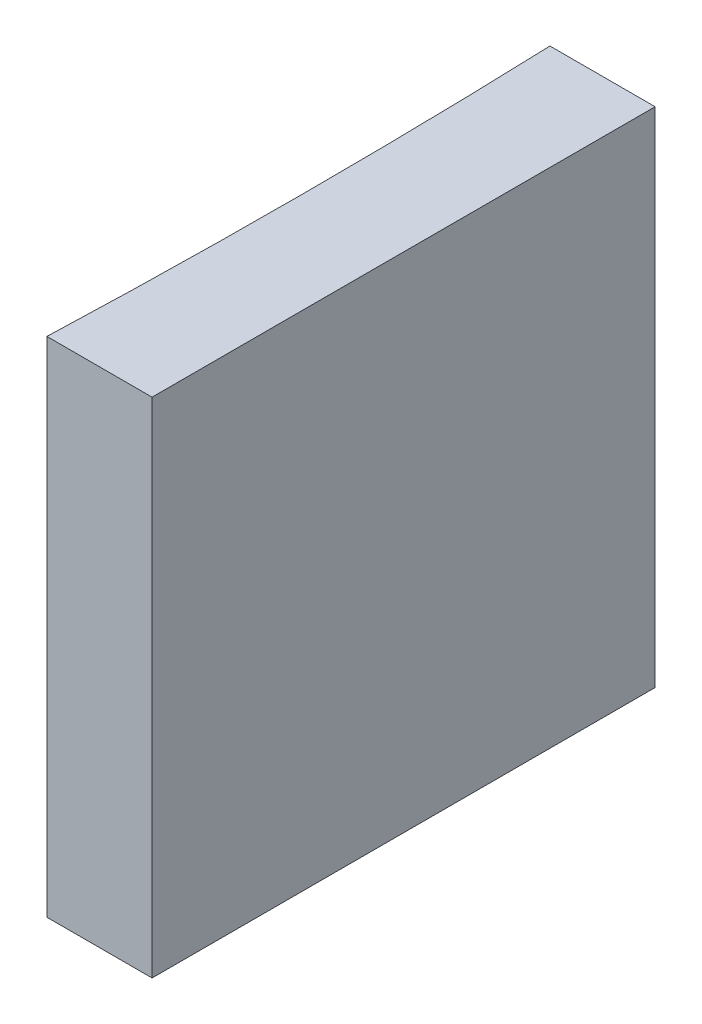
ISO-10303-21;
HEADER;
FILE_DESCRIPTION(('STEP AP214'),'2;1');
FILE_NAME('part.step','',(''),(''),'','','');
FILE_SCHEMA(('AUTOMOTIVE_DESIGN { 1 0 10303 214 1 1 1 1 }'));
ENDSEC;
DATA;
#1=APPLICATION_CONTEXT('core data for automotive mechanical design processes');
#2=APPLICATION_PROTOCOL_DEFINITION('international standard','automotive_design',2000,#1);
#3=PRODUCT_CONTEXT('',#1,'mechanical');
#4=PRODUCT('Part','Part','',(#3));
#5=PRODUCT_RELATED_PRODUCT_CATEGORY('part','',(#4));
#6=PRODUCT_DEFINITION_FORMATION('','',#4);
#7=PRODUCT_DEFINITION_CONTEXT('part definition',#1,'design');
#8=PRODUCT_DEFINITION('design','',#6,#7);
#9=PRODUCT_DEFINITION_SHAPE('','',#8);
#10=(LENGTH_UNIT() NAMED_UNIT(*) SI_UNIT(.MILLI.,.METRE.));
#11=(NAMED_UNIT(*) PLANE_ANGLE_UNIT() SI_UNIT($,.RADIAN.));
#12=(NAMED_UNIT(*) SI_UNIT($,.STERADIAN.) SOLID_ANGLE_UNIT());
#13=UNCERTAINTY_MEASURE_WITH_UNIT(LENGTH_MEASURE(1.E-05),#10,'distance_accuracy_value','');
#14=(GEOMETRIC_REPRESENTATION_CONTEXT(3) GLOBAL_UNCERTAINTY_ASSIGNED_CONTEXT((#13)) GLOBAL_UNIT_ASSIGNED_CONTEXT((#10,
#11,#12)) REPRESENTATION_CONTEXT('',''));
#15=CARTESIAN_POINT('',(0.,0.,0.));
#16=DIRECTION('',(0.,0.,1.));
#17=DIRECTION('',(1.,0.,0.));
#18=AXIS2_PLACEMENT_3D('',#15,#16,#17);
#19=CARTESIAN_POINT('',(0.,10.,0.));
#20=DIRECTION('',(0.,0.,1.));
#21=DIRECTION('',(1.,0.,0.));
#22=AXIS2_PLACEMENT_3D('',#19,#20,#21);
#23=PLANE('',#22);
#24=DIRECTION('',(-1.,0.,0.));
#25=VECTOR('',#24,1.);
#26=CARTESIAN_POINT('',(0.,0.,0.));
#27=LINE('',#26,#25);
#28=CARTESIAN_POINT('',(0.,0.,0.));
#29=VERTEX_POINT('',#28);
#30=CARTESIAN_POINT('',(-2.09090608475551,0.,0.));
#31=VERTEX_POINT('',#30);
#32=EDGE_CURVE('E98',#29,#31,#27,.T.);
#33=ORIENTED_EDGE('',*,*,#32,.T.);
#34=DIRECTION('',(0.,-1.,0.));
#35=VECTOR('',#34,1.);
#36=CARTESIAN_POINT('',(-2.09090608475551,10.,0.));
#37=LINE('',#36,#35);
#38=CARTESIAN_POINT('',(-2.09090608475551,10.,0.));
#39=VERTEX_POINT('',#38);
#40=EDGE_CURVE('E11',#39,#31,#37,.T.);
#41=ORIENTED_EDGE('',*,*,#40,.F.);
#42=DIRECTION('',(-1.,0.,0.));
#43=VECTOR('',#42,1.);
#44=CARTESIAN_POINT('',(0.,10.,0.));
#45=LINE('',#44,#43);
#46=CARTESIAN_POINT('',(0.,10.,0.));
#47=VERTEX_POINT('',#46);
#48=EDGE_CURVE('E86',#47,#39,#45,.T.);
#49=ORIENTED_EDGE('',*,*,#48,.F.);
#50=DIRECTION('',(0.,-1.,0.));
#51=VECTOR('',#50,1.);
#52=CARTESIAN_POINT('',(0.,10.,0.));
#53=LINE('',#52,#51);
#54=EDGE_CURVE('E94',#47,#29,#53,.T.);
#55=ORIENTED_EDGE('',*,*,#54,.T.);
#56=EDGE_LOOP('',(#33,#41,#49,#55));
#57=FACE_BOUND('',#56,.T.);
#58=ADVANCED_FACE('F35',(#57),#23,.F.);
#59=CARTESIAN_POINT('',(-139.55,10.,5.00000000000002));
#60=DIRECTION('',(0.,-1.,0.));
#61=DIRECTION('',(0.,0.,-1.));
#62=AXIS2_PLACEMENT_3D('',#59,#60,#61);
#63=CYLINDRICAL_SURFACE('',#62,137.55);
#64=CARTESIAN_POINT('',(-139.55,0.,5.00000000000002));
#65=DIRECTION('',(0.,-1.,0.));
#66=DIRECTION('',(0.,0.,1.));
#67=AXIS2_PLACEMENT_3D('',#64,#65,#66);
#68=CIRCLE('',#67,137.55);
#69=CARTESIAN_POINT('',(-2.09090608475554,0.,10.));
#70=VERTEX_POINT('',#69);
#71=EDGE_CURVE('E90',#31,#70,#68,.T.);
#72=ORIENTED_EDGE('',*,*,#71,.T.);
#73=DIRECTION('',(0.,-1.,0.));
#74=VECTOR('',#73,1.);
#75=CARTESIAN_POINT('',(-2.09090608475554,10.,10.));
#76=LINE('',#75,#74);
#77=CARTESIAN_POINT('',(-2.09090608475554,10.,10.));
#78=VERTEX_POINT('',#77);
#79=EDGE_CURVE('E43',#78,#70,#76,.T.);
#80=ORIENTED_EDGE('',*,*,#79,.F.);
#81=CARTESIAN_POINT('',(-139.55,10.,5.00000000000002));
#82=DIRECTION('',(0.,-1.,0.));
#83=DIRECTION('',(0.,0.,1.));
#84=AXIS2_PLACEMENT_3D('',#81,#82,#83);
#85=CIRCLE('',#84,137.55);
#86=EDGE_CURVE('E81',#39,#78,#85,.T.);
#87=ORIENTED_EDGE('',*,*,#86,.F.);
#88=ORIENTED_EDGE('',*,*,#40,.T.);
#89=EDGE_LOOP('',(#72,#80,#87,#88));
#90=FACE_BOUND('',#89,.T.);
#91=ADVANCED_FACE('F89',(#90),#63,.F.);
#92=CARTESIAN_POINT('',(0.,10.,10.));
#93=DIRECTION('',(0.,0.,-1.));
#94=DIRECTION('',(-1.,0.,0.));
#95=AXIS2_PLACEMENT_3D('',#92,#93,#94);
#96=PLANE('',#95);
#97=DIRECTION('',(1.,0.,0.));
#98=VECTOR('',#97,1.);
#99=CARTESIAN_POINT('',(0.,0.,10.));
#100=LINE('',#99,#98);
#101=CARTESIAN_POINT('',(0.,0.,10.));
#102=VERTEX_POINT('',#101);
#103=EDGE_CURVE('E68',#70,#102,#100,.T.);
#104=ORIENTED_EDGE('',*,*,#103,.T.);
#105=DIRECTION('',(0.,-1.,0.));
#106=VECTOR('',#105,1.);
#107=CARTESIAN_POINT('',(0.,10.,10.));
#108=LINE('',#107,#106);
#109=CARTESIAN_POINT('',(0.,10.,10.));
#110=VERTEX_POINT('',#109);
#111=EDGE_CURVE('E91',#110,#102,#108,.T.);
#112=ORIENTED_EDGE('',*,*,#111,.F.);
#113=DIRECTION('',(1.,0.,0.));
#114=VECTOR('',#113,1.);
#115=CARTESIAN_POINT('',(0.,10.,10.));
#116=LINE('',#115,#114);
#117=EDGE_CURVE('E84',#78,#110,#116,.T.);
#118=ORIENTED_EDGE('',*,*,#117,.F.);
#119=ORIENTED_EDGE('',*,*,#79,.T.);
#120=EDGE_LOOP('',(#104,#112,#118,#119));
#121=FACE_BOUND('',#120,.T.);
#122=ADVANCED_FACE('F92',(#121),#96,.F.);
#123=CARTESIAN_POINT('',(0.,10.,0.));
#124=DIRECTION('',(-1.,0.,0.));
#125=DIRECTION('',(0.,0.,1.));
#126=AXIS2_PLACEMENT_3D('',#123,#124,#125);
#127=PLANE('',#126);
#128=DIRECTION('',(0.,0.,-1.));
#129=VECTOR('',#128,1.);
#130=CARTESIAN_POINT('',(0.,0.,0.));
#131=LINE('',#130,#129);
#132=EDGE_CURVE('E74',#102,#29,#131,.T.);
#133=ORIENTED_EDGE('',*,*,#132,.T.);
#134=ORIENTED_EDGE('',*,*,#54,.F.);
#135=DIRECTION('',(0.,0.,-1.));
#136=VECTOR('',#135,1.);
#137=CARTESIAN_POINT('',(0.,10.,0.));
#138=LINE('',#137,#136);
#139=EDGE_CURVE('E51',#110,#47,#138,.T.);
#140=ORIENTED_EDGE('',*,*,#139,.F.);
#141=ORIENTED_EDGE('',*,*,#111,.T.);
#142=EDGE_LOOP('',(#133,#134,#140,#141));
#143=FACE_BOUND('',#142,.T.);
#144=ADVANCED_FACE('F105',(#143),#127,.F.);
#145=CARTESIAN_POINT('',(-139.55,10.,5.00000000000002));
#146=DIRECTION('',(0.,1.,0.));
#147=DIRECTION('',(0.,0.,1.));
#148=AXIS2_PLACEMENT_3D('',#145,#146,#147);
#149=PLANE('',#148);
#150=ORIENTED_EDGE('',*,*,#48,.T.);
#151=ORIENTED_EDGE('',*,*,#86,.T.);
#152=ORIENTED_EDGE('',*,*,#117,.T.);
#153=ORIENTED_EDGE('',*,*,#139,.T.);
#154=EDGE_LOOP('',(#150,#151,#152,#153));
#155=FACE_BOUND('',#154,.T.);
#156=ADVANCED_FACE('F82',(#155),#149,.T.);
#157=CARTESIAN_POINT('',(-139.55,0.,5.00000000000002));
#158=DIRECTION('',(0.,1.,0.));
#159=DIRECTION('',(0.,0.,1.));
#160=AXIS2_PLACEMENT_3D('',#157,#158,#159);
#161=PLANE('',#160);
#162=ORIENTED_EDGE('',*,*,#32,.F.);
#163=ORIENTED_EDGE('',*,*,#132,.F.);
#164=ORIENTED_EDGE('',*,*,#103,.F.);
#165=ORIENTED_EDGE('',*,*,#71,.F.);
#166=EDGE_LOOP('',(#162,#163,#164,#165));
#167=FACE_BOUND('',#166,.T.);
#168=ADVANCED_FACE('F108',(#167),#161,.F.);
#169=CLOSED_SHELL('',(#58,#91,#122,#144,#156,#168));
#170=MANIFOLD_SOLID_BREP('B2',#169);
#171=ADVANCED_BREP_SHAPE_REPRESENTATION('',(#18,#170),#14);
#172=SHAPE_DEFINITION_REPRESENTATION(#9,#171);
ENDSEC;
END-ISO-10303-21;
